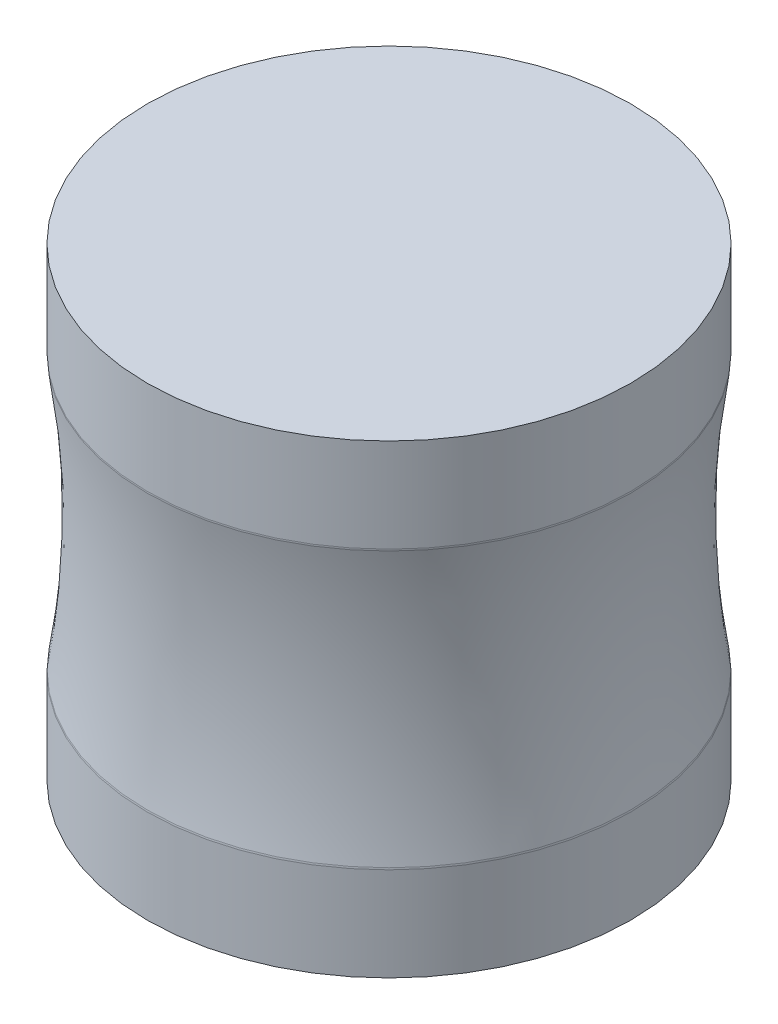
ISO-10303-21;
HEADER;
FILE_DESCRIPTION(('STEP AP214'),'2;1');
FILE_NAME('part.step','',(''),(''),'','','');
FILE_SCHEMA(('AUTOMOTIVE_DESIGN { 1 0 10303 214 1 1 1 1 }'));
ENDSEC;
DATA;
#1=APPLICATION_CONTEXT('core data for automotive mechanical design processes');
#2=APPLICATION_PROTOCOL_DEFINITION('international standard','automotive_design',2000,#1);
#3=PRODUCT_CONTEXT('',#1,'mechanical');
#4=PRODUCT('Part','Part','',(#3));
#5=PRODUCT_RELATED_PRODUCT_CATEGORY('part','',(#4));
#6=PRODUCT_DEFINITION_FORMATION('','',#4);
#7=PRODUCT_DEFINITION_CONTEXT('part definition',#1,'design');
#8=PRODUCT_DEFINITION('design','',#6,#7);
#9=PRODUCT_DEFINITION_SHAPE('','',#8);
#10=(LENGTH_UNIT() NAMED_UNIT(*) SI_UNIT(.MILLI.,.METRE.));
#11=(NAMED_UNIT(*) PLANE_ANGLE_UNIT() SI_UNIT($,.RADIAN.));
#12=(NAMED_UNIT(*) SI_UNIT($,.STERADIAN.) SOLID_ANGLE_UNIT());
#13=UNCERTAINTY_MEASURE_WITH_UNIT(LENGTH_MEASURE(1.E-05),#10,'distance_accuracy_value','');
#14=(GEOMETRIC_REPRESENTATION_CONTEXT(3) GLOBAL_UNCERTAINTY_ASSIGNED_CONTEXT((#13)) GLOBAL_UNIT_ASSIGNED_CONTEXT((#10,
#11,#12)) REPRESENTATION_CONTEXT('',''));
#15=CARTESIAN_POINT('',(0.,0.,0.));
#16=DIRECTION('',(0.,0.,1.));
#17=DIRECTION('',(1.,0.,0.));
#18=AXIS2_PLACEMENT_3D('',#15,#16,#17);
#19=CARTESIAN_POINT('',(0.,105.259657320872,0.));
#20=DIRECTION('',(0.,-1.,0.));
#21=DIRECTION('',(0.,0.,-1.));
#22=AXIS2_PLACEMENT_3D('',#19,#20,#21);
#23=PLANE('',#22);
#24=CARTESIAN_POINT('',(0.,105.259657320872,0.));
#25=DIRECTION('',(0.,1.,0.));
#26=DIRECTION('',(0.,0.,1.));
#27=AXIS2_PLACEMENT_3D('',#24,#25,#26);
#28=CIRCLE('',#27,109.52729583908);
#29=CARTESIAN_POINT('',(0.,105.259657320872,109.52729583908));
#30=VERTEX_POINT('',#29);
#31=EDGE_CURVE('E10',#30,#30,#28,.T.);
#32=ORIENTED_EDGE('',*,*,#31,.T.);
#33=EDGE_LOOP('',(#32));
#34=FACE_BOUND('',#33,.T.);
#35=ADVANCED_FACE('F31',(#34),#23,.F.);
#36=CARTESIAN_POINT('',(0.,105.259657320872,0.));
#37=DIRECTION('',(0.,1.,0.));
#38=DIRECTION('',(0.,0.,1.));
#39=AXIS2_PLACEMENT_3D('',#36,#37,#38);
#40=CYLINDRICAL_SURFACE('',#39,109.52729583908);
#41=ORIENTED_EDGE('',*,*,#31,.F.);
#42=EDGE_LOOP('',(#41));
#43=FACE_BOUND('',#42,.T.);
#44=CARTESIAN_POINT('',(0.,62.8726866346396,0.));
#45=DIRECTION('',(0.,1.,0.));
#46=DIRECTION('',(0.,0.,1.));
#47=AXIS2_PLACEMENT_3D('',#44,#45,#46);
#48=CIRCLE('',#47,109.52729583908);
#49=CARTESIAN_POINT('',(0.,62.8726866346396,109.52729583908));
#50=VERTEX_POINT('',#49);
#51=EDGE_CURVE('E37',#50,#50,#48,.T.);
#52=ORIENTED_EDGE('',*,*,#51,.T.);
#53=EDGE_LOOP('',(#52));
#54=FACE_BOUND('',#53,.T.);
#55=ADVANCED_FACE('F69',(#43,#54),#40,.T.);
#56=CARTESIAN_POINT('',(0.,62.8726866346396,0.));
#57=DIRECTION('',(0.,1.,0.));
#58=DIRECTION('',(0.,0.,1.));
#59=AXIS2_PLACEMENT_3D('',#56,#57,#58);
#60=TOROIDAL_SURFACE('',#59,104.52729583908,5.00000000000003);
#61=ORIENTED_EDGE('',*,*,#51,.F.);
#62=EDGE_LOOP('',(#61));
#63=FACE_BOUND('',#62,.T.);
#64=CARTESIAN_POINT('',(0.,62.0824266281478,0.));
#65=DIRECTION('',(0.,1.,0.));
#66=DIRECTION('',(0.,0.,1.));
#67=AXIS2_PLACEMENT_3D('',#64,#65,#66);
#68=CIRCLE('',#67,109.464449788689);
#69=CARTESIAN_POINT('',(0.,62.0824266281478,109.464449788689));
#70=VERTEX_POINT('',#69);
#71=EDGE_CURVE('E41',#70,#70,#68,.T.);
#72=ORIENTED_EDGE('',*,*,#71,.T.);
#73=EDGE_LOOP('',(#72));
#74=FACE_BOUND('',#73,.T.);
#75=ADVANCED_FACE('F73',(#63,#74),#60,.T.);
#76=CARTESIAN_POINT('',(0.,0.,0.));
#77=DIRECTION('',(0.,1.,0.));
#78=DIRECTION('',(0.,0.,1.));
#79=AXIS2_PLACEMENT_3D('',#76,#77,#78);
#80=TOROIDAL_SURFACE('',#79,497.324768304838,392.797472465758);
#81=ORIENTED_EDGE('',*,*,#71,.F.);
#82=EDGE_LOOP('',(#81));
#83=FACE_BOUND('',#82,.T.);
#84=CARTESIAN_POINT('',(0.,-62.0824266281477,0.));
#85=DIRECTION('',(0.,1.,0.));
#86=DIRECTION('',(0.,0.,1.));
#87=AXIS2_PLACEMENT_3D('',#84,#85,#86);
#88=CIRCLE('',#87,109.464449788689);
#89=CARTESIAN_POINT('',(0.,-62.0824266281477,109.464449788689));
#90=VERTEX_POINT('',#89);
#91=EDGE_CURVE('E45',#90,#90,#88,.T.);
#92=ORIENTED_EDGE('',*,*,#91,.T.);
#93=EDGE_LOOP('',(#92));
#94=FACE_BOUND('',#93,.T.);
#95=ADVANCED_FACE('F78',(#83,#94),#80,.F.);
#96=CARTESIAN_POINT('',(0.,-62.8726866346396,0.));
#97=DIRECTION('',(0.,1.,0.));
#98=DIRECTION('',(0.,0.,1.));
#99=AXIS2_PLACEMENT_3D('',#96,#97,#98);
#100=TOROIDAL_SURFACE('',#99,104.52729583908,5.);
#101=ORIENTED_EDGE('',*,*,#91,.F.);
#102=EDGE_LOOP('',(#101));
#103=FACE_BOUND('',#102,.T.);
#104=CARTESIAN_POINT('',(0.,-62.8726866346396,0.));
#105=DIRECTION('',(0.,1.,0.));
#106=DIRECTION('',(0.,0.,1.));
#107=AXIS2_PLACEMENT_3D('',#104,#105,#106);
#108=CIRCLE('',#107,109.52729583908);
#109=CARTESIAN_POINT('',(0.,-62.8726866346396,109.52729583908));
#110=VERTEX_POINT('',#109);
#111=EDGE_CURVE('E50',#110,#110,#108,.T.);
#112=ORIENTED_EDGE('',*,*,#111,.T.);
#113=EDGE_LOOP('',(#112));
#114=FACE_BOUND('',#113,.T.);
#115=ADVANCED_FACE('F65',(#103,#114),#100,.T.);
#116=CARTESIAN_POINT('',(0.,105.259657320872,0.));
#117=DIRECTION('',(0.,1.,0.));
#118=DIRECTION('',(0.,0.,1.));
#119=AXIS2_PLACEMENT_3D('',#116,#117,#118);
#120=CYLINDRICAL_SURFACE('',#119,109.52729583908);
#121=ORIENTED_EDGE('',*,*,#111,.F.);
#122=EDGE_LOOP('',(#121));
#123=FACE_BOUND('',#122,.T.);
#124=CARTESIAN_POINT('',(0.,-105.259657320872,0.));
#125=DIRECTION('',(0.,1.,0.));
#126=DIRECTION('',(0.,0.,1.));
#127=AXIS2_PLACEMENT_3D('',#124,#125,#126);
#128=CIRCLE('',#127,109.52729583908);
#129=CARTESIAN_POINT('',(0.,-105.259657320872,109.52729583908));
#130=VERTEX_POINT('',#129);
#131=EDGE_CURVE('E53',#130,#130,#128,.T.);
#132=ORIENTED_EDGE('',*,*,#131,.T.);
#133=EDGE_LOOP('',(#132));
#134=FACE_BOUND('',#133,.T.);
#135=ADVANCED_FACE('F57',(#123,#134),#120,.T.);
#136=CARTESIAN_POINT('',(0.,-105.259657320872,0.));
#137=DIRECTION('',(0.,1.,0.));
#138=DIRECTION('',(0.,0.,1.));
#139=AXIS2_PLACEMENT_3D('',#136,#137,#138);
#140=PLANE('',#139);
#141=ORIENTED_EDGE('',*,*,#131,.F.);
#142=EDGE_LOOP('',(#141));
#143=FACE_BOUND('',#142,.T.);
#144=ADVANCED_FACE('F59',(#143),#140,.F.);
#145=CLOSED_SHELL('',(#35,#55,#75,#95,#115,#135,#144));
#146=MANIFOLD_SOLID_BREP('B2',#145);
#147=ADVANCED_BREP_SHAPE_REPRESENTATION('',(#18,#146),#14);
#148=SHAPE_DEFINITION_REPRESENTATION(#9,#147);
ENDSEC;
END-ISO-10303-21;
